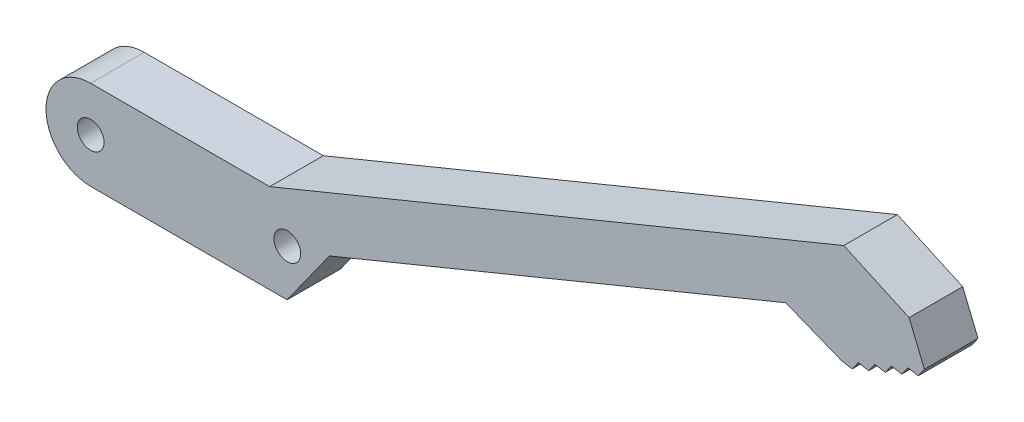
ISO-10303-21;
HEADER;
FILE_DESCRIPTION(('STEP AP214'),'2;1');
FILE_NAME('part.step','',(''),(''),'','','');
FILE_SCHEMA(('AUTOMOTIVE_DESIGN { 1 0 10303 214 1 1 1 1 }'));
ENDSEC;
DATA;
#1=APPLICATION_CONTEXT('core data for automotive mechanical design processes');
#2=APPLICATION_PROTOCOL_DEFINITION('international standard','automotive_design',2000,#1);
#3=PRODUCT_CONTEXT('',#1,'mechanical');
#4=PRODUCT('Part','Part','',(#3));
#5=PRODUCT_RELATED_PRODUCT_CATEGORY('part','',(#4));
#6=PRODUCT_DEFINITION_FORMATION('','',#4);
#7=PRODUCT_DEFINITION_CONTEXT('part definition',#1,'design');
#8=PRODUCT_DEFINITION('design','',#6,#7);
#9=PRODUCT_DEFINITION_SHAPE('','',#8);
#10=(LENGTH_UNIT() NAMED_UNIT(*) SI_UNIT(.MILLI.,.METRE.));
#11=(NAMED_UNIT(*) PLANE_ANGLE_UNIT() SI_UNIT($,.RADIAN.));
#12=(NAMED_UNIT(*) SI_UNIT($,.STERADIAN.) SOLID_ANGLE_UNIT());
#13=UNCERTAINTY_MEASURE_WITH_UNIT(LENGTH_MEASURE(1.E-05),#10,'distance_accuracy_value','');
#14=(GEOMETRIC_REPRESENTATION_CONTEXT(3) GLOBAL_UNCERTAINTY_ASSIGNED_CONTEXT((#13)) GLOBAL_UNIT_ASSIGNED_CONTEXT((#10,
#11,#12)) REPRESENTATION_CONTEXT('',''));
#15=CARTESIAN_POINT('',(0.,0.,0.));
#16=DIRECTION('',(0.,0.,1.));
#17=DIRECTION('',(1.,0.,0.));
#18=AXIS2_PLACEMENT_3D('',#15,#16,#17);
#19=CARTESIAN_POINT('',(16.9314341640706,-12.095211761983,6.));
#20=DIRECTION('',(0.813703233651607,-0.581280523968349,0.));
#21=DIRECTION('',(0.581280523968349,0.813703233651607,0.));
#22=AXIS2_PLACEMENT_3D('',#19,#20,#21);
#23=PLANE('',#22);
#24=DIRECTION('',(-0.581280523968349,-0.813703233651607,0.));
#25=VECTOR('',#24,1.);
#26=CARTESIAN_POINT('',(16.9314341640706,-12.095211761983,0.));
#27=LINE('',#26,#25);
#28=CARTESIAN_POINT('',(26.7298984201175,1.62112952455076,0.));
#29=VERTEX_POINT('',#28);
#30=CARTESIAN_POINT('',(22.,-5.,0.));
#31=VERTEX_POINT('',#30);
#32=EDGE_CURVE('E223',#29,#31,#27,.T.);
#33=ORIENTED_EDGE('',*,*,#32,.F.);
#34=DIRECTION('',(0.,0.,-1.));
#35=VECTOR('',#34,1.);
#36=CARTESIAN_POINT('',(26.7298984201175,1.62112952455076,6.));
#37=LINE('',#36,#35);
#38=CARTESIAN_POINT('',(26.7298984201175,1.62112952455076,6.));
#39=VERTEX_POINT('',#38);
#40=EDGE_CURVE('E11',#39,#29,#37,.T.);
#41=ORIENTED_EDGE('',*,*,#40,.F.);
#42=DIRECTION('',(-0.581280523968349,-0.813703233651607,0.));
#43=VECTOR('',#42,1.);
#44=CARTESIAN_POINT('',(16.9314341640706,-12.095211761983,6.));
#45=LINE('',#44,#43);
#46=CARTESIAN_POINT('',(22.,-5.,6.));
#47=VERTEX_POINT('',#46);
#48=EDGE_CURVE('E375',#39,#47,#45,.T.);
#49=ORIENTED_EDGE('',*,*,#48,.T.);
#50=DIRECTION('',(0.,0.,-1.));
#51=VECTOR('',#50,1.);
#52=CARTESIAN_POINT('',(22.,-5.,6.));
#53=LINE('',#52,#51);
#54=EDGE_CURVE('E131',#47,#31,#53,.T.);
#55=ORIENTED_EDGE('',*,*,#54,.T.);
#56=EDGE_LOOP('',(#33,#41,#49,#55));
#57=FACE_BOUND('',#56,.T.);
#58=ADVANCED_FACE('F45',(#57),#23,.T.);
#59=CARTESIAN_POINT('',(3.2950033831404,-8.01412070884608,6.));
#60=DIRECTION('',(0.380263412733207,-0.924878228166549,0.));
#61=DIRECTION('',(0.924878228166549,0.380263412733207,0.));
#62=AXIS2_PLACEMENT_3D('',#59,#60,#61);
#63=PLANE('',#62);
#64=DIRECTION('',(-0.924878228166549,-0.380263412733207,0.));
#65=VECTOR('',#64,1.);
#66=CARTESIAN_POINT('',(3.2950033831404,-8.01412070884608,0.));
#67=LINE('',#66,#65);
#68=CARTESIAN_POINT('',(77.8201717440377,22.6268804439331,0.));
#69=VERTEX_POINT('',#68);
#70=EDGE_CURVE('E226',#69,#29,#67,.T.);
#71=ORIENTED_EDGE('',*,*,#70,.F.);
#72=DIRECTION('',(0.,0.,-1.));
#73=VECTOR('',#72,1.);
#74=CARTESIAN_POINT('',(77.8201717440377,22.6268804439331,6.));
#75=LINE('',#74,#73);
#76=CARTESIAN_POINT('',(77.8201717440377,22.6268804439331,6.));
#77=VERTEX_POINT('',#76);
#78=EDGE_CURVE('E55',#77,#69,#75,.T.);
#79=ORIENTED_EDGE('',*,*,#78,.F.);
#80=DIRECTION('',(-0.924878228166549,-0.380263412733207,0.));
#81=VECTOR('',#80,1.);
#82=CARTESIAN_POINT('',(3.2950033831404,-8.01412070884608,6.));
#83=LINE('',#82,#81);
#84=EDGE_CURVE('E371',#77,#39,#83,.T.);
#85=ORIENTED_EDGE('',*,*,#84,.T.);
#86=ORIENTED_EDGE('',*,*,#40,.T.);
#87=EDGE_LOOP('',(#71,#79,#85,#86));
#88=FACE_BOUND('',#87,.T.);
#89=ADVANCED_FACE('F358',(#88),#63,.T.);
#90=CARTESIAN_POINT('',(18.3513503152322,46.2323048159079,6.));
#91=DIRECTION('',(-0.368935795459582,-0.929454882621316,0.));
#92=DIRECTION('',(0.929454882621317,-0.368935795459582,0.));
#93=AXIS2_PLACEMENT_3D('',#90,#91,#92);
#94=PLANE('',#93);
#95=DIRECTION('',(-0.929454882621317,0.368935795459582,0.));
#96=VECTOR('',#95,1.);
#97=CARTESIAN_POINT('',(18.3513503152322,46.2323048159079,0.));
#98=LINE('',#97,#96);
#99=CARTESIAN_POINT('',(84.1084953802089,20.1308069645243,0.));
#100=VERTEX_POINT('',#99);
#101=EDGE_CURVE('E230',#100,#69,#98,.T.);
#102=ORIENTED_EDGE('',*,*,#101,.F.);
#103=DIRECTION('',(0.,0.,-1.));
#104=VECTOR('',#103,1.);
#105=CARTESIAN_POINT('',(84.1084953802089,20.1308069645243,6.));
#106=LINE('',#105,#104);
#107=CARTESIAN_POINT('',(84.1084953802089,20.1308069645243,6.));
#108=VERTEX_POINT('',#107);
#109=EDGE_CURVE('E345',#108,#100,#106,.T.);
#110=ORIENTED_EDGE('',*,*,#109,.F.);
#111=DIRECTION('',(-0.929454882621317,0.368935795459582,0.));
#112=VECTOR('',#111,1.);
#113=CARTESIAN_POINT('',(18.3513503152322,46.2323048159079,6.));
#114=LINE('',#113,#112);
#115=EDGE_CURVE('E354',#108,#77,#114,.T.);
#116=ORIENTED_EDGE('',*,*,#115,.T.);
#117=ORIENTED_EDGE('',*,*,#78,.T.);
#118=EDGE_LOOP('',(#102,#110,#116,#117));
#119=FACE_BOUND('',#118,.T.);
#120=ADVANCED_FACE('F352',(#119),#94,.T.);
#121=CARTESIAN_POINT('',(5.86343688777284,33.7317785640365,6.));
#122=DIRECTION('',(0.171257275030372,0.985226342395072,0.));
#123=DIRECTION('',(-0.985226342395072,0.171257275030372,0.));
#124=AXIS2_PLACEMENT_3D('',#121,#122,#123);
#125=PLANE('',#124);
#126=DIRECTION('',(0.985226342395072,-0.171257275030372,0.));
#127=VECTOR('',#126,1.);
#128=CARTESIAN_POINT('',(5.86343688777284,33.7317785640365,0.));
#129=LINE('',#128,#127);
#130=CARTESIAN_POINT('',(85.2729395583973,19.9283970935126,0.));
#131=VERTEX_POINT('',#130);
#132=EDGE_CURVE('E234',#100,#131,#129,.T.);
#133=ORIENTED_EDGE('',*,*,#132,.T.);
#134=DIRECTION('',(0.,0.,-1.));
#135=VECTOR('',#134,1.);
#136=CARTESIAN_POINT('',(85.2729395583973,19.9283970935126,6.));
#137=LINE('',#136,#135);
#138=CARTESIAN_POINT('',(85.2729395583973,19.9283970935126,6.));
#139=VERTEX_POINT('',#138);
#140=EDGE_CURVE('E341',#139,#131,#137,.T.);
#141=ORIENTED_EDGE('',*,*,#140,.F.);
#142=DIRECTION('',(0.985226342395072,-0.171257275030372,0.));
#143=VECTOR('',#142,1.);
#144=CARTESIAN_POINT('',(5.86343688777284,33.7317785640365,6.));
#145=LINE('',#144,#143);
#146=EDGE_CURVE('E366',#108,#139,#145,.T.);
#147=ORIENTED_EDGE('',*,*,#146,.F.);
#148=ORIENTED_EDGE('',*,*,#109,.T.);
#149=EDGE_LOOP('',(#133,#141,#147,#148));
#150=FACE_BOUND('',#149,.T.);
#151=ADVANCED_FACE('F363',(#150),#125,.F.);
#152=CARTESIAN_POINT('',(47.1888389635574,-33.583817972036,6.));
#153=DIRECTION('',(-0.814732571298575,0.579836905746101,0.));
#154=DIRECTION('',(-0.579836905746101,-0.814732571298575,0.));
#155=AXIS2_PLACEMENT_3D('',#152,#153,#154);
#156=PLANE('',#155);
#157=DIRECTION('',(0.579836905746101,0.814732571298575,0.));
#158=VECTOR('',#157,1.);
#159=CARTESIAN_POINT('',(47.1888389635574,-33.583817972036,0.));
#160=LINE('',#159,#158);
#161=CARTESIAN_POINT('',(85.9582518365419,20.8913337899907,0.));
#162=VERTEX_POINT('',#161);
#163=EDGE_CURVE('E238',#131,#162,#160,.T.);
#164=ORIENTED_EDGE('',*,*,#163,.T.);
#165=DIRECTION('',(0.,0.,-1.));
#166=VECTOR('',#165,1.);
#167=CARTESIAN_POINT('',(85.9582518365419,20.8913337899907,6.));
#168=LINE('',#167,#166);
#169=CARTESIAN_POINT('',(85.9582518365419,20.8913337899907,6.));
#170=VERTEX_POINT('',#169);
#171=EDGE_CURVE('E337',#170,#162,#168,.T.);
#172=ORIENTED_EDGE('',*,*,#171,.F.);
#173=DIRECTION('',(0.579836905746101,0.814732571298575,0.));
#174=VECTOR('',#173,1.);
#175=CARTESIAN_POINT('',(47.1888389635574,-33.583817972036,6.));
#176=LINE('',#175,#174);
#177=EDGE_CURVE('E369',#139,#170,#176,.T.);
#178=ORIENTED_EDGE('',*,*,#177,.F.);
#179=ORIENTED_EDGE('',*,*,#140,.T.);
#180=EDGE_LOOP('',(#164,#172,#178,#179));
#181=FACE_BOUND('',#180,.T.);
#182=ADVANCED_FACE('F453',(#181),#156,.F.);
#183=CARTESIAN_POINT('',(6.04601004080759,34.7821040451136,6.));
#184=DIRECTION('',(0.171257275030364,0.985226342395073,0.));
#185=DIRECTION('',(-0.985226342395073,0.171257275030364,0.));
#186=AXIS2_PLACEMENT_3D('',#183,#184,#185);
#187=PLANE('',#186);
#188=DIRECTION('',(0.985226342395073,-0.171257275030364,0.));
#189=VECTOR('',#188,1.);
#190=CARTESIAN_POINT('',(6.04601004080759,34.7821040451136,0.));
#191=LINE('',#190,#189);
#192=CARTESIAN_POINT('',(87.1226960147304,20.688923918979,0.));
#193=VERTEX_POINT('',#192);
#194=EDGE_CURVE('E242',#162,#193,#191,.T.);
#195=ORIENTED_EDGE('',*,*,#194,.T.);
#196=DIRECTION('',(0.,0.,-1.));
#197=VECTOR('',#196,1.);
#198=CARTESIAN_POINT('',(87.1226960147304,20.688923918979,6.));
#199=LINE('',#198,#197);
#200=CARTESIAN_POINT('',(87.1226960147304,20.688923918979,6.));
#201=VERTEX_POINT('',#200);
#202=EDGE_CURVE('E333',#201,#193,#199,.T.);
#203=ORIENTED_EDGE('',*,*,#202,.F.);
#204=DIRECTION('',(0.985226342395073,-0.171257275030364,0.));
#205=VECTOR('',#204,1.);
#206=CARTESIAN_POINT('',(6.04601004080759,34.7821040451136,6.));
#207=LINE('',#206,#205);
#208=EDGE_CURVE('E381',#170,#201,#207,.T.);
#209=ORIENTED_EDGE('',*,*,#208,.F.);
#210=ORIENTED_EDGE('',*,*,#171,.T.);
#211=EDGE_LOOP('',(#195,#203,#209,#210));
#212=FACE_BOUND('',#211,.T.);
#213=ADVANCED_FACE('F450',(#212),#187,.F.);
#214=CARTESIAN_POINT('',(48.0574052442941,-34.2019677826612,6.));
#215=DIRECTION('',(-0.814732571298568,0.57983690574611,0.));
#216=DIRECTION('',(-0.57983690574611,-0.814732571298568,0.));
#217=AXIS2_PLACEMENT_3D('',#214,#215,#216);
#218=PLANE('',#217);
#219=DIRECTION('',(0.57983690574611,0.814732571298568,0.));
#220=VECTOR('',#219,1.);
#221=CARTESIAN_POINT('',(48.0574052442941,-34.2019677826612,0.));
#222=LINE('',#221,#220);
#223=CARTESIAN_POINT('',(87.8080082928751,21.6518606154571,0.));
#224=VERTEX_POINT('',#223);
#225=EDGE_CURVE('E246',#193,#224,#222,.T.);
#226=ORIENTED_EDGE('',*,*,#225,.T.);
#227=DIRECTION('',(0.,0.,-1.));
#228=VECTOR('',#227,1.);
#229=CARTESIAN_POINT('',(87.8080082928751,21.6518606154571,6.));
#230=LINE('',#229,#228);
#231=CARTESIAN_POINT('',(87.8080082928751,21.6518606154571,6.));
#232=VERTEX_POINT('',#231);
#233=EDGE_CURVE('E329',#232,#224,#230,.T.);
#234=ORIENTED_EDGE('',*,*,#233,.F.);
#235=DIRECTION('',(0.57983690574611,0.814732571298568,0.));
#236=VECTOR('',#235,1.);
#237=CARTESIAN_POINT('',(48.0574052442941,-34.2019677826612,6.));
#238=LINE('',#237,#236);
#239=EDGE_CURVE('E385',#201,#232,#238,.T.);
#240=ORIENTED_EDGE('',*,*,#239,.F.);
#241=ORIENTED_EDGE('',*,*,#202,.T.);
#242=EDGE_LOOP('',(#226,#234,#240,#241));
#243=FACE_BOUND('',#242,.T.);
#244=ADVANCED_FACE('F447',(#243),#218,.F.);
#245=CARTESIAN_POINT('',(6.22858319384296,35.8324295261917,6.));
#246=DIRECTION('',(0.171257275030369,0.985226342395073,0.));
#247=DIRECTION('',(-0.985226342395073,0.171257275030369,0.));
#248=AXIS2_PLACEMENT_3D('',#245,#246,#247);
#249=PLANE('',#248);
#250=DIRECTION('',(0.985226342395072,-0.171257275030369,0.));
#251=VECTOR('',#250,1.);
#252=CARTESIAN_POINT('',(6.22858319384296,35.8324295261917,0.));
#253=LINE('',#252,#251);
#254=CARTESIAN_POINT('',(88.9724524710635,21.4494507444454,0.));
#255=VERTEX_POINT('',#254);
#256=EDGE_CURVE('E250',#224,#255,#253,.T.);
#257=ORIENTED_EDGE('',*,*,#256,.T.);
#258=DIRECTION('',(0.,0.,-1.));
#259=VECTOR('',#258,1.);
#260=CARTESIAN_POINT('',(88.9724524710635,21.4494507444454,6.));
#261=LINE('',#260,#259);
#262=CARTESIAN_POINT('',(88.9724524710635,21.4494507444454,6.));
#263=VERTEX_POINT('',#262);
#264=EDGE_CURVE('E325',#263,#255,#261,.T.);
#265=ORIENTED_EDGE('',*,*,#264,.F.);
#266=DIRECTION('',(0.985226342395072,-0.171257275030369,0.));
#267=VECTOR('',#266,1.);
#268=CARTESIAN_POINT('',(6.22858319384296,35.8324295261917,6.));
#269=LINE('',#268,#267);
#270=EDGE_CURVE('E389',#232,#263,#269,.T.);
#271=ORIENTED_EDGE('',*,*,#270,.F.);
#272=ORIENTED_EDGE('',*,*,#233,.T.);
#273=EDGE_LOOP('',(#257,#265,#271,#272));
#274=FACE_BOUND('',#273,.T.);
#275=ADVANCED_FACE('F445',(#274),#249,.F.);
#276=CARTESIAN_POINT('',(48.9259715250317,-34.8201175932863,6.));
#277=DIRECTION('',(-0.814732571298568,0.57983690574611,0.));
#278=DIRECTION('',(-0.57983690574611,-0.814732571298568,0.));
#279=AXIS2_PLACEMENT_3D('',#276,#277,#278);
#280=PLANE('',#279);
#281=DIRECTION('',(0.57983690574611,0.814732571298568,0.));
#282=VECTOR('',#281,1.);
#283=CARTESIAN_POINT('',(48.9259715250317,-34.8201175932863,0.));
#284=LINE('',#283,#282);
#285=CARTESIAN_POINT('',(89.6577647492082,22.4123874409235,0.));
#286=VERTEX_POINT('',#285);
#287=EDGE_CURVE('E254',#255,#286,#284,.T.);
#288=ORIENTED_EDGE('',*,*,#287,.T.);
#289=DIRECTION('',(0.,0.,-1.));
#290=VECTOR('',#289,1.);
#291=CARTESIAN_POINT('',(89.6577647492082,22.4123874409235,6.));
#292=LINE('',#291,#290);
#293=CARTESIAN_POINT('',(89.6577647492082,22.4123874409235,6.));
#294=VERTEX_POINT('',#293);
#295=EDGE_CURVE('E321',#294,#286,#292,.T.);
#296=ORIENTED_EDGE('',*,*,#295,.F.);
#297=DIRECTION('',(0.57983690574611,0.814732571298568,0.));
#298=VECTOR('',#297,1.);
#299=CARTESIAN_POINT('',(48.9259715250317,-34.8201175932863,6.));
#300=LINE('',#299,#298);
#301=EDGE_CURVE('E393',#263,#294,#300,.T.);
#302=ORIENTED_EDGE('',*,*,#301,.F.);
#303=ORIENTED_EDGE('',*,*,#264,.T.);
#304=EDGE_LOOP('',(#288,#296,#302,#303));
#305=FACE_BOUND('',#304,.T.);
#306=ADVANCED_FACE('F441',(#305),#280,.F.);
#307=CARTESIAN_POINT('',(6.41115634687818,36.8827550072696,6.));
#308=DIRECTION('',(0.171257275030371,0.985226342395072,0.));
#309=DIRECTION('',(-0.985226342395072,0.171257275030371,0.));
#310=AXIS2_PLACEMENT_3D('',#307,#308,#309);
#311=PLANE('',#310);
#312=DIRECTION('',(0.985226342395072,-0.171257275030371,0.));
#313=VECTOR('',#312,1.);
#314=CARTESIAN_POINT('',(6.41115634687818,36.8827550072696,0.));
#315=LINE('',#314,#313);
#316=CARTESIAN_POINT('',(90.8222089273966,22.2099775699118,0.));
#317=VERTEX_POINT('',#316);
#318=EDGE_CURVE('E258',#286,#317,#315,.T.);
#319=ORIENTED_EDGE('',*,*,#318,.T.);
#320=DIRECTION('',(0.,0.,-1.));
#321=VECTOR('',#320,1.);
#322=CARTESIAN_POINT('',(90.8222089273966,22.2099775699118,6.));
#323=LINE('',#322,#321);
#324=CARTESIAN_POINT('',(90.8222089273966,22.2099775699118,6.));
#325=VERTEX_POINT('',#324);
#326=EDGE_CURVE('E317',#325,#317,#323,.T.);
#327=ORIENTED_EDGE('',*,*,#326,.F.);
#328=DIRECTION('',(0.985226342395072,-0.171257275030371,0.));
#329=VECTOR('',#328,1.);
#330=CARTESIAN_POINT('',(6.41115634687818,36.8827550072696,6.));
#331=LINE('',#330,#329);
#332=EDGE_CURVE('E397',#294,#325,#331,.T.);
#333=ORIENTED_EDGE('',*,*,#332,.F.);
#334=ORIENTED_EDGE('',*,*,#295,.T.);
#335=EDGE_LOOP('',(#319,#327,#333,#334));
#336=FACE_BOUND('',#335,.T.);
#337=ADVANCED_FACE('F438',(#336),#311,.F.);
#338=CARTESIAN_POINT('',(49.7945378057698,-35.4382674039114,6.));
#339=DIRECTION('',(-0.814732571298571,0.579836905746106,0.));
#340=DIRECTION('',(-0.579836905746107,-0.814732571298571,0.));
#341=AXIS2_PLACEMENT_3D('',#338,#339,#340);
#342=PLANE('',#341);
#343=DIRECTION('',(0.579836905746107,0.814732571298571,0.));
#344=VECTOR('',#343,1.);
#345=CARTESIAN_POINT('',(49.7945378057698,-35.4382674039114,0.));
#346=LINE('',#345,#344);
#347=CARTESIAN_POINT('',(91.5075212055413,23.1729142663899,0.));
#348=VERTEX_POINT('',#347);
#349=EDGE_CURVE('E262',#317,#348,#346,.T.);
#350=ORIENTED_EDGE('',*,*,#349,.T.);
#351=DIRECTION('',(0.,0.,-1.));
#352=VECTOR('',#351,1.);
#353=CARTESIAN_POINT('',(91.5075212055413,23.1729142663899,6.));
#354=LINE('',#353,#352);
#355=CARTESIAN_POINT('',(91.5075212055413,23.1729142663899,6.));
#356=VERTEX_POINT('',#355);
#357=EDGE_CURVE('E313',#356,#348,#354,.T.);
#358=ORIENTED_EDGE('',*,*,#357,.F.);
#359=DIRECTION('',(0.579836905746107,0.814732571298571,0.));
#360=VECTOR('',#359,1.);
#361=CARTESIAN_POINT('',(49.7945378057698,-35.4382674039114,6.));
#362=LINE('',#361,#360);
#363=EDGE_CURVE('E401',#325,#356,#362,.T.);
#364=ORIENTED_EDGE('',*,*,#363,.F.);
#365=ORIENTED_EDGE('',*,*,#326,.T.);
#366=EDGE_LOOP('',(#350,#358,#364,#365));
#367=FACE_BOUND('',#366,.T.);
#368=ADVANCED_FACE('F436',(#367),#342,.F.);
#369=CARTESIAN_POINT('',(6.5937294999132,37.9330804883471,6.));
#370=DIRECTION('',(0.171257275030369,0.985226342395073,0.));
#371=DIRECTION('',(-0.985226342395073,0.171257275030369,0.));
#372=AXIS2_PLACEMENT_3D('',#369,#370,#371);
#373=PLANE('',#372);
#374=DIRECTION('',(0.985226342395072,-0.171257275030369,0.));
#375=VECTOR('',#374,1.);
#376=CARTESIAN_POINT('',(6.5937294999132,37.9330804883471,0.));
#377=LINE('',#376,#375);
#378=CARTESIAN_POINT('',(92.6719653837297,22.9705043953782,0.));
#379=VERTEX_POINT('',#378);
#380=EDGE_CURVE('E266',#348,#379,#377,.T.);
#381=ORIENTED_EDGE('',*,*,#380,.T.);
#382=DIRECTION('',(0.,0.,-1.));
#383=VECTOR('',#382,1.);
#384=CARTESIAN_POINT('',(92.6719653837297,22.9705043953782,6.));
#385=LINE('',#384,#383);
#386=CARTESIAN_POINT('',(92.6719653837297,22.9705043953782,6.));
#387=VERTEX_POINT('',#386);
#388=EDGE_CURVE('E309',#387,#379,#385,.T.);
#389=ORIENTED_EDGE('',*,*,#388,.F.);
#390=DIRECTION('',(0.985226342395072,-0.171257275030369,0.));
#391=VECTOR('',#390,1.);
#392=CARTESIAN_POINT('',(6.5937294999132,37.9330804883471,6.));
#393=LINE('',#392,#391);
#394=EDGE_CURVE('E405',#356,#387,#393,.T.);
#395=ORIENTED_EDGE('',*,*,#394,.F.);
#396=ORIENTED_EDGE('',*,*,#357,.T.);
#397=EDGE_LOOP('',(#381,#389,#395,#396));
#398=FACE_BOUND('',#397,.T.);
#399=ADVANCED_FACE('F432',(#398),#373,.F.);
#400=CARTESIAN_POINT('',(50.6631040865079,-36.0564172145365,6.));
#401=DIRECTION('',(-0.814732571298574,0.579836905746102,0.));
#402=DIRECTION('',(-0.579836905746102,-0.814732571298574,0.));
#403=AXIS2_PLACEMENT_3D('',#400,#401,#402);
#404=PLANE('',#403);
#405=DIRECTION('',(0.579836905746102,0.814732571298574,0.));
#406=VECTOR('',#405,1.);
#407=CARTESIAN_POINT('',(50.6631040865079,-36.0564172145365,0.));
#408=LINE('',#407,#406);
#409=CARTESIAN_POINT('',(93.3572776618743,23.9334410918563,0.));
#410=VERTEX_POINT('',#409);
#411=EDGE_CURVE('E270',#379,#410,#408,.T.);
#412=ORIENTED_EDGE('',*,*,#411,.T.);
#413=DIRECTION('',(0.,0.,-1.));
#414=VECTOR('',#413,1.);
#415=CARTESIAN_POINT('',(93.3572776618743,23.9334410918563,6.));
#416=LINE('',#415,#414);
#417=CARTESIAN_POINT('',(93.3572776618743,23.9334410918563,6.));
#418=VERTEX_POINT('',#417);
#419=EDGE_CURVE('E306',#418,#410,#416,.T.);
#420=ORIENTED_EDGE('',*,*,#419,.F.);
#421=DIRECTION('',(0.579836905746102,0.814732571298574,0.));
#422=VECTOR('',#421,1.);
#423=CARTESIAN_POINT('',(50.6631040865079,-36.0564172145365,6.));
#424=LINE('',#423,#422);
#425=EDGE_CURVE('E409',#387,#418,#424,.T.);
#426=ORIENTED_EDGE('',*,*,#425,.F.);
#427=ORIENTED_EDGE('',*,*,#388,.T.);
#428=EDGE_LOOP('',(#412,#420,#426,#427));
#429=FACE_BOUND('',#428,.T.);
#430=ADVANCED_FACE('F429',(#429),#404,.F.);
#431=CARTESIAN_POINT('',(88.2751185950938,36.2942891659839,6.));
#432=DIRECTION('',(0.924878228166546,0.380263412733213,0.));
#433=DIRECTION('',(-0.380263412733213,0.924878228166547,0.));
#434=AXIS2_PLACEMENT_3D('',#431,#432,#433);
#435=PLANE('',#434);
#436=DIRECTION('',(0.380263412733213,-0.924878228166546,0.));
#437=VECTOR('',#436,1.);
#438=CARTESIAN_POINT('',(88.2751185950938,36.2942891659839,0.));
#439=LINE('',#438,#437);
#440=CARTESIAN_POINT('',(91.6460923045749,28.0953931186058,0.));
#441=VERTEX_POINT('',#440);
#442=EDGE_CURVE('E274',#441,#410,#439,.T.);
#443=ORIENTED_EDGE('',*,*,#442,.F.);
#444=DIRECTION('',(0.,0.,-1.));
#445=VECTOR('',#444,1.);
#446=CARTESIAN_POINT('',(91.6460923045749,28.0953931186058,6.));
#447=LINE('',#446,#445);
#448=CARTESIAN_POINT('',(91.6460923045749,28.0953931186058,6.));
#449=VERTEX_POINT('',#448);
#450=EDGE_CURVE('E303',#449,#441,#447,.T.);
#451=ORIENTED_EDGE('',*,*,#450,.F.);
#452=DIRECTION('',(0.380263412733213,-0.924878228166546,0.));
#453=VECTOR('',#452,1.);
#454=CARTESIAN_POINT('',(88.2751185950938,36.2942891659839,6.));
#455=LINE('',#454,#453);
#456=EDGE_CURVE('E412',#449,#418,#455,.T.);
#457=ORIENTED_EDGE('',*,*,#456,.T.);
#458=ORIENTED_EDGE('',*,*,#419,.T.);
#459=EDGE_LOOP('',(#443,#451,#457,#458));
#460=FACE_BOUND('',#459,.T.);
#461=ADVANCED_FACE('F426',(#460),#435,.T.);
#462=CARTESIAN_POINT('',(26.3458964010933,57.8395904994658,6.));
#463=DIRECTION('',(0.414522259932085,0.910039172794664,0.));
#464=DIRECTION('',(-0.910039172794665,0.414522259932085,0.));
#465=AXIS2_PLACEMENT_3D('',#462,#463,#464);
#466=PLANE('',#465);
#467=DIRECTION('',(0.910039172794664,-0.414522259932085,0.));
#468=VECTOR('',#467,1.);
#469=CARTESIAN_POINT('',(26.3458964010933,57.8395904994658,0.));
#470=LINE('',#469,#468);
#471=CARTESIAN_POINT('',(84.3290368575751,31.4283071849578,0.));
#472=VERTEX_POINT('',#471);
#473=EDGE_CURVE('E278',#472,#441,#470,.T.);
#474=ORIENTED_EDGE('',*,*,#473,.F.);
#475=DIRECTION('',(0.,0.,-1.));
#476=VECTOR('',#475,1.);
#477=CARTESIAN_POINT('',(84.3290368575751,31.4283071849578,6.));
#478=LINE('',#477,#476);
#479=CARTESIAN_POINT('',(84.3290368575751,31.4283071849578,6.));
#480=VERTEX_POINT('',#479);
#481=EDGE_CURVE('E300',#480,#472,#478,.T.);
#482=ORIENTED_EDGE('',*,*,#481,.F.);
#483=DIRECTION('',(0.910039172794664,-0.414522259932085,0.));
#484=VECTOR('',#483,1.);
#485=CARTESIAN_POINT('',(26.3458964010933,57.8395904994658,6.));
#486=LINE('',#485,#484);
#487=EDGE_CURVE('E209',#480,#449,#486,.T.);
#488=ORIENTED_EDGE('',*,*,#487,.T.);
#489=ORIENTED_EDGE('',*,*,#450,.T.);
#490=EDGE_LOOP('',(#474,#482,#488,#489));
#491=FACE_BOUND('',#490,.T.);
#492=ADVANCED_FACE('F419',(#491),#466,.T.);
#493=CARTESIAN_POINT('',(1.14074851739701,-2.77453321099285,6.));
#494=DIRECTION('',(-0.380263412733206,0.924878228166549,0.));
#495=DIRECTION('',(-0.924878228166549,-0.380263412733207,0.));
#496=AXIS2_PLACEMENT_3D('',#493,#494,#495);
#497=PLANE('',#496);
#498=DIRECTION('',(0.924878228166549,0.380263412733207,0.));
#499=VECTOR('',#498,1.);
#500=CARTESIAN_POINT('',(1.14074851739701,-2.77453321099285,0.));
#501=LINE('',#500,#499);
#502=CARTESIAN_POINT('',(20.05,5.,0.));
#503=VERTEX_POINT('',#502);
#504=EDGE_CURVE('E282',#503,#472,#501,.T.);
#505=ORIENTED_EDGE('',*,*,#504,.F.);
#506=DIRECTION('',(0.,0.,-1.));
#507=VECTOR('',#506,1.);
#508=CARTESIAN_POINT('',(20.05,5.,6.));
#509=LINE('',#508,#507);
#510=CARTESIAN_POINT('',(20.05,5.,6.));
#511=VERTEX_POINT('',#510);
#512=EDGE_CURVE('E193',#511,#503,#509,.T.);
#513=ORIENTED_EDGE('',*,*,#512,.F.);
#514=DIRECTION('',(0.924878228166549,0.380263412733207,0.));
#515=VECTOR('',#514,1.);
#516=CARTESIAN_POINT('',(1.14074851739701,-2.77453321099285,6.));
#517=LINE('',#516,#515);
#518=EDGE_CURVE('E205',#511,#480,#517,.T.);
#519=ORIENTED_EDGE('',*,*,#518,.T.);
#520=ORIENTED_EDGE('',*,*,#481,.T.);
#521=EDGE_LOOP('',(#505,#513,#519,#520));
#522=FACE_BOUND('',#521,.T.);
#523=ADVANCED_FACE('F424',(#522),#497,.T.);
#524=CARTESIAN_POINT('',(0.,5.,6.));
#525=DIRECTION('',(0.,1.,0.));
#526=DIRECTION('',(-1.,0.,0.));
#527=AXIS2_PLACEMENT_3D('',#524,#525,#526);
#528=PLANE('',#527);
#529=DIRECTION('',(1.,0.,0.));
#530=VECTOR('',#529,1.);
#531=CARTESIAN_POINT('',(0.,5.,0.));
#532=LINE('',#531,#530);
#533=CARTESIAN_POINT('',(0.,5.,0.));
#534=VERTEX_POINT('',#533);
#535=EDGE_CURVE('E189',#534,#503,#532,.T.);
#536=ORIENTED_EDGE('',*,*,#535,.F.);
#537=DIRECTION('',(0.,0.,-1.));
#538=VECTOR('',#537,1.);
#539=CARTESIAN_POINT('',(0.,5.,6.));
#540=LINE('',#539,#538);
#541=CARTESIAN_POINT('',(0.,5.,6.));
#542=VERTEX_POINT('',#541);
#543=EDGE_CURVE('E183',#542,#534,#540,.T.);
#544=ORIENTED_EDGE('',*,*,#543,.F.);
#545=DIRECTION('',(1.,0.,0.));
#546=VECTOR('',#545,1.);
#547=CARTESIAN_POINT('',(0.,5.,6.));
#548=LINE('',#547,#546);
#549=EDGE_CURVE('E187',#542,#511,#548,.T.);
#550=ORIENTED_EDGE('',*,*,#549,.T.);
#551=ORIENTED_EDGE('',*,*,#512,.T.);
#552=EDGE_LOOP('',(#536,#544,#550,#551));
#553=FACE_BOUND('',#552,.T.);
#554=ADVANCED_FACE('F185',(#553),#528,.T.);
#555=CARTESIAN_POINT('',(0.,0.,6.));
#556=DIRECTION('',(0.,0.,-1.));
#557=DIRECTION('',(-1.,0.,0.));
#558=AXIS2_PLACEMENT_3D('',#555,#556,#557);
#559=CYLINDRICAL_SURFACE('',#558,5.);
#560=CARTESIAN_POINT('',(0.,0.,0.));
#561=DIRECTION('',(0.,0.,1.));
#562=DIRECTION('',(1.,0.,0.));
#563=AXIS2_PLACEMENT_3D('',#560,#561,#562);
#564=CIRCLE('',#563,5.);
#565=CARTESIAN_POINT('',(0.,-5.,0.));
#566=VERTEX_POINT('',#565);
#567=EDGE_CURVE('E288',#534,#566,#564,.T.);
#568=ORIENTED_EDGE('',*,*,#567,.T.);
#569=DIRECTION('',(0.,0.,-1.));
#570=VECTOR('',#569,1.);
#571=CARTESIAN_POINT('',(0.,-5.,6.));
#572=LINE('',#571,#570);
#573=CARTESIAN_POINT('',(0.,-5.,6.));
#574=VERTEX_POINT('',#573);
#575=EDGE_CURVE('E194',#574,#566,#572,.T.);
#576=ORIENTED_EDGE('',*,*,#575,.F.);
#577=CARTESIAN_POINT('',(0.,0.,6.));
#578=DIRECTION('',(0.,0.,1.));
#579=DIRECTION('',(1.,0.,0.));
#580=AXIS2_PLACEMENT_3D('',#577,#578,#579);
#581=CIRCLE('',#580,5.);
#582=EDGE_CURVE('E197',#542,#574,#581,.T.);
#583=ORIENTED_EDGE('',*,*,#582,.F.);
#584=ORIENTED_EDGE('',*,*,#543,.T.);
#585=EDGE_LOOP('',(#568,#576,#583,#584));
#586=FACE_BOUND('',#585,.T.);
#587=ADVANCED_FACE('F198',(#586),#559,.T.);
#588=CARTESIAN_POINT('',(0.,0.,6.));
#589=DIRECTION('',(0.,0.,-1.));
#590=DIRECTION('',(-1.,0.,0.));
#591=AXIS2_PLACEMENT_3D('',#588,#589,#590);
#592=CYLINDRICAL_SURFACE('',#591,1.5);
#593=CARTESIAN_POINT('',(0.,0.,6.));
#594=DIRECTION('',(0.,0.,1.));
#595=DIRECTION('',(1.,0.,0.));
#596=AXIS2_PLACEMENT_3D('',#593,#594,#595);
#597=CIRCLE('',#596,1.5);
#598=CARTESIAN_POINT('',(1.5,0.,6.));
#599=VERTEX_POINT('',#598);
#600=EDGE_CURVE('E482',#599,#599,#597,.T.);
#601=ORIENTED_EDGE('',*,*,#600,.T.);
#602=EDGE_LOOP('',(#601));
#603=FACE_BOUND('',#602,.T.);
#604=CARTESIAN_POINT('',(0.,0.,0.));
#605=DIRECTION('',(0.,0.,1.));
#606=DIRECTION('',(1.,0.,0.));
#607=AXIS2_PLACEMENT_3D('',#604,#605,#606);
#608=CIRCLE('',#607,1.5);
#609=CARTESIAN_POINT('',(1.5,0.,0.));
#610=VERTEX_POINT('',#609);
#611=EDGE_CURVE('E219',#610,#610,#608,.T.);
#612=ORIENTED_EDGE('',*,*,#611,.F.);
#613=EDGE_LOOP('',(#612));
#614=FACE_BOUND('',#613,.T.);
#615=ADVANCED_FACE('F469',(#603,#614),#592,.F.);
#616=CARTESIAN_POINT('',(22.0207052746916,0.206842568432915,6.));
#617=DIRECTION('',(0.,0.,-1.));
#618=DIRECTION('',(-1.,0.,0.));
#619=AXIS2_PLACEMENT_3D('',#616,#617,#618);
#620=CYLINDRICAL_SURFACE('',#619,1.5);
#621=CARTESIAN_POINT('',(22.0207052746916,0.206842568432915,6.));
#622=DIRECTION('',(0.,0.,1.));
#623=DIRECTION('',(1.,0.,0.));
#624=AXIS2_PLACEMENT_3D('',#621,#622,#623);
#625=CIRCLE('',#624,1.5);
#626=CARTESIAN_POINT('',(23.5207052746916,0.206842568432915,6.));
#627=VERTEX_POINT('',#626);
#628=EDGE_CURVE('E293',#627,#627,#625,.T.);
#629=ORIENTED_EDGE('',*,*,#628,.T.);
#630=EDGE_LOOP('',(#629));
#631=FACE_BOUND('',#630,.T.);
#632=CARTESIAN_POINT('',(22.0207052746916,0.206842568432915,0.));
#633=DIRECTION('',(0.,0.,1.));
#634=DIRECTION('',(1.,0.,0.));
#635=AXIS2_PLACEMENT_3D('',#632,#633,#634);
#636=CIRCLE('',#635,1.5);
#637=CARTESIAN_POINT('',(23.5207052746916,0.206842568432915,0.));
#638=VERTEX_POINT('',#637);
#639=EDGE_CURVE('E215',#638,#638,#636,.T.);
#640=ORIENTED_EDGE('',*,*,#639,.F.);
#641=EDGE_LOOP('',(#640));
#642=FACE_BOUND('',#641,.T.);
#643=ADVANCED_FACE('F47',(#631,#642),#620,.F.);
#644=CARTESIAN_POINT('',(0.,-5.,6.));
#645=DIRECTION('',(0.,1.,0.));
#646=DIRECTION('',(-1.,0.,0.));
#647=AXIS2_PLACEMENT_3D('',#644,#645,#646);
#648=PLANE('',#647);
#649=DIRECTION('',(1.,0.,0.));
#650=VECTOR('',#649,1.);
#651=CARTESIAN_POINT('',(0.,-5.,0.));
#652=LINE('',#651,#650);
#653=EDGE_CURVE('E124',#566,#31,#652,.T.);
#654=ORIENTED_EDGE('',*,*,#653,.T.);
#655=ORIENTED_EDGE('',*,*,#54,.F.);
#656=DIRECTION('',(1.,0.,0.));
#657=VECTOR('',#656,1.);
#658=CARTESIAN_POINT('',(0.,-5.,6.));
#659=LINE('',#658,#657);
#660=EDGE_CURVE('E63',#574,#47,#659,.T.);
#661=ORIENTED_EDGE('',*,*,#660,.F.);
#662=ORIENTED_EDGE('',*,*,#575,.T.);
#663=EDGE_LOOP('',(#654,#655,#661,#662));
#664=FACE_BOUND('',#663,.T.);
#665=ADVANCED_FACE('F476',(#664),#648,.F.);
#666=CARTESIAN_POINT('',(0.,0.,6.));
#667=DIRECTION('',(0.,0.,1.));
#668=DIRECTION('',(1.,0.,0.));
#669=AXIS2_PLACEMENT_3D('',#666,#667,#668);
#670=PLANE('',#669);
#671=ORIENTED_EDGE('',*,*,#628,.F.);
#672=EDGE_LOOP('',(#671));
#673=FACE_BOUND('',#672,.T.);
#674=ORIENTED_EDGE('',*,*,#600,.F.);
#675=EDGE_LOOP('',(#674));
#676=FACE_BOUND('',#675,.T.);
#677=ORIENTED_EDGE('',*,*,#48,.F.);
#678=ORIENTED_EDGE('',*,*,#84,.F.);
#679=ORIENTED_EDGE('',*,*,#115,.F.);
#680=ORIENTED_EDGE('',*,*,#146,.T.);
#681=ORIENTED_EDGE('',*,*,#177,.T.);
#682=ORIENTED_EDGE('',*,*,#208,.T.);
#683=ORIENTED_EDGE('',*,*,#239,.T.);
#684=ORIENTED_EDGE('',*,*,#270,.T.);
#685=ORIENTED_EDGE('',*,*,#301,.T.);
#686=ORIENTED_EDGE('',*,*,#332,.T.);
#687=ORIENTED_EDGE('',*,*,#363,.T.);
#688=ORIENTED_EDGE('',*,*,#394,.T.);
#689=ORIENTED_EDGE('',*,*,#425,.T.);
#690=ORIENTED_EDGE('',*,*,#456,.F.);
#691=ORIENTED_EDGE('',*,*,#487,.F.);
#692=ORIENTED_EDGE('',*,*,#518,.F.);
#693=ORIENTED_EDGE('',*,*,#549,.F.);
#694=ORIENTED_EDGE('',*,*,#582,.T.);
#695=ORIENTED_EDGE('',*,*,#660,.T.);
#696=EDGE_LOOP('',(#677,#678,#679,#680,#681,#682,#683,#684,#685,#686,#687,#688,#689,#690,#691,
#692,#693,#694,#695));
#697=FACE_BOUND('',#696,.T.);
#698=ADVANCED_FACE('F202',(#673,#676,#697),#670,.T.);
#699=CARTESIAN_POINT('',(0.,0.,0.));
#700=DIRECTION('',(0.,0.,1.));
#701=DIRECTION('',(1.,0.,0.));
#702=AXIS2_PLACEMENT_3D('',#699,#700,#701);
#703=PLANE('',#702);
#704=ORIENTED_EDGE('',*,*,#639,.T.);
#705=EDGE_LOOP('',(#704));
#706=FACE_BOUND('',#705,.T.);
#707=ORIENTED_EDGE('',*,*,#611,.T.);
#708=EDGE_LOOP('',(#707));
#709=FACE_BOUND('',#708,.T.);
#710=ORIENTED_EDGE('',*,*,#32,.T.);
#711=ORIENTED_EDGE('',*,*,#653,.F.);
#712=ORIENTED_EDGE('',*,*,#567,.F.);
#713=ORIENTED_EDGE('',*,*,#535,.T.);
#714=ORIENTED_EDGE('',*,*,#504,.T.);
#715=ORIENTED_EDGE('',*,*,#473,.T.);
#716=ORIENTED_EDGE('',*,*,#442,.T.);
#717=ORIENTED_EDGE('',*,*,#411,.F.);
#718=ORIENTED_EDGE('',*,*,#380,.F.);
#719=ORIENTED_EDGE('',*,*,#349,.F.);
#720=ORIENTED_EDGE('',*,*,#318,.F.);
#721=ORIENTED_EDGE('',*,*,#287,.F.);
#722=ORIENTED_EDGE('',*,*,#256,.F.);
#723=ORIENTED_EDGE('',*,*,#225,.F.);
#724=ORIENTED_EDGE('',*,*,#194,.F.);
#725=ORIENTED_EDGE('',*,*,#163,.F.);
#726=ORIENTED_EDGE('',*,*,#132,.F.);
#727=ORIENTED_EDGE('',*,*,#101,.T.);
#728=ORIENTED_EDGE('',*,*,#70,.T.);
#729=EDGE_LOOP('',(#710,#711,#712,#713,#714,#715,#716,#717,#718,#719,#720,#721,#722,#723,#724,
#725,#726,#727,#728));
#730=FACE_BOUND('',#729,.T.);
#731=ADVANCED_FACE('F360',(#706,#709,#730),#703,.F.);
#732=CLOSED_SHELL('',(#58,#89,#120,#151,#182,#213,#244,#275,#306,#337,#368,#399,#430,#461,#492,
#523,#554,#587,#615,#643,#665,#698,#731));
#733=MANIFOLD_SOLID_BREP('B2',#732);
#734=ADVANCED_BREP_SHAPE_REPRESENTATION('',(#18,#733),#14);
#735=SHAPE_DEFINITION_REPRESENTATION(#9,#734);
ENDSEC;
END-ISO-10303-21;
